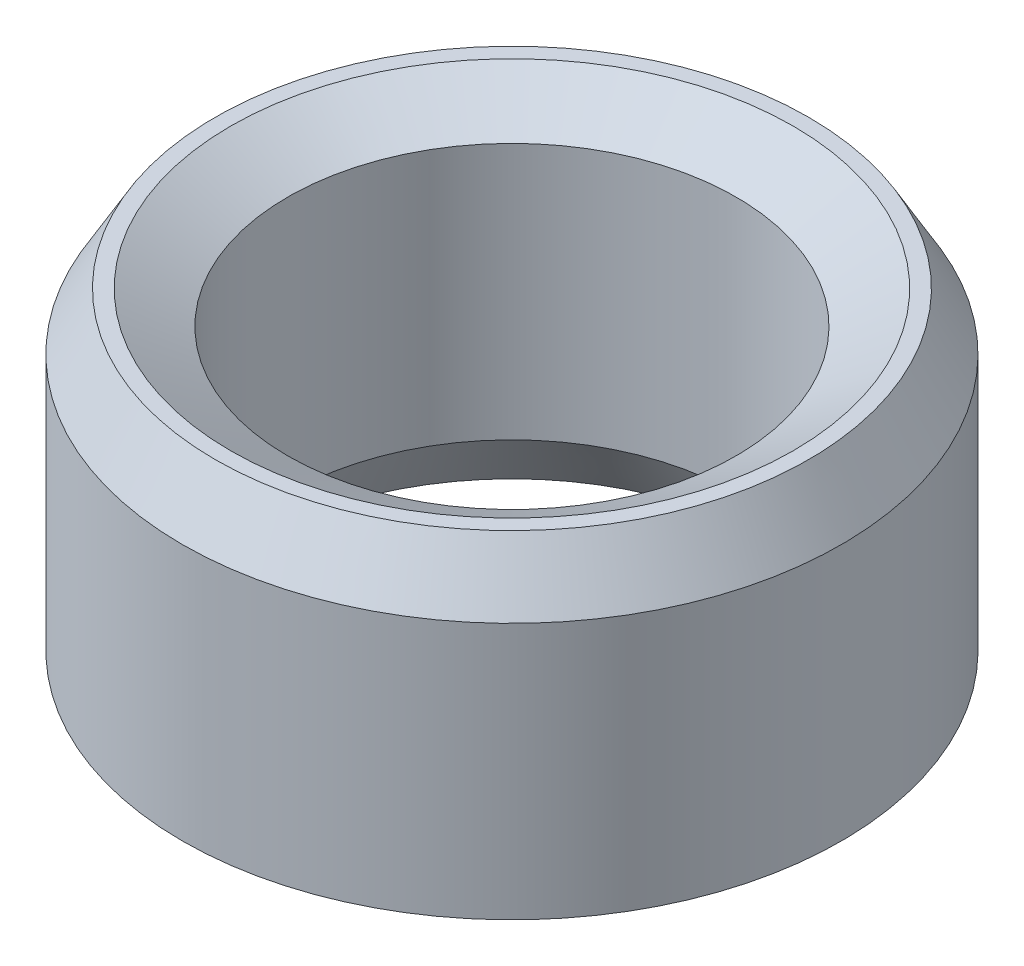
ISO-10303-21;
HEADER;
FILE_DESCRIPTION(('STEP AP214'),'2;1');
FILE_NAME('part.step','',(''),(''),'','','');
FILE_SCHEMA(('AUTOMOTIVE_DESIGN { 1 0 10303 214 1 1 1 1 }'));
ENDSEC;
DATA;
#1=APPLICATION_CONTEXT('core data for automotive mechanical design processes');
#2=APPLICATION_PROTOCOL_DEFINITION('international standard','automotive_design',2000,#1);
#3=PRODUCT_CONTEXT('',#1,'mechanical');
#4=PRODUCT('Part','Part','',(#3));
#5=PRODUCT_RELATED_PRODUCT_CATEGORY('part','',(#4));
#6=PRODUCT_DEFINITION_FORMATION('','',#4);
#7=PRODUCT_DEFINITION_CONTEXT('part definition',#1,'design');
#8=PRODUCT_DEFINITION('design','',#6,#7);
#9=PRODUCT_DEFINITION_SHAPE('','',#8);
#10=(LENGTH_UNIT() NAMED_UNIT(*) SI_UNIT(.MILLI.,.METRE.));
#11=(NAMED_UNIT(*) PLANE_ANGLE_UNIT() SI_UNIT($,.RADIAN.));
#12=(NAMED_UNIT(*) SI_UNIT($,.STERADIAN.) SOLID_ANGLE_UNIT());
#13=UNCERTAINTY_MEASURE_WITH_UNIT(LENGTH_MEASURE(1.E-05),#10,'distance_accuracy_value','');
#14=(GEOMETRIC_REPRESENTATION_CONTEXT(3) GLOBAL_UNCERTAINTY_ASSIGNED_CONTEXT((#13)) GLOBAL_UNIT_ASSIGNED_CONTEXT((#10,
#11,#12)) REPRESENTATION_CONTEXT('',''));
#15=CARTESIAN_POINT('',(0.,0.,0.));
#16=DIRECTION('',(0.,0.,1.));
#17=DIRECTION('',(1.,0.,0.));
#18=AXIS2_PLACEMENT_3D('',#15,#16,#17);
#19=CARTESIAN_POINT('',(0.,10.5202298279563,0.));
#20=DIRECTION('',(0.,-1.,0.));
#21=DIRECTION('',(0.,0.,-1.));
#22=AXIS2_PLACEMENT_3D('',#19,#20,#21);
#23=CYLINDRICAL_SURFACE('',#22,10.);
#24=CARTESIAN_POINT('',(0.,0.999339456152843,0.));
#25=DIRECTION('',(0.,1.,0.));
#26=DIRECTION('',(0.,0.,1.));
#27=AXIS2_PLACEMENT_3D('',#24,#25,#26);
#28=CIRCLE('',#27,10.);
#29=CARTESIAN_POINT('',(0.,0.999339456152843,10.));
#30=VERTEX_POINT('',#29);
#31=EDGE_CURVE('E10',#30,#30,#28,.T.);
#32=ORIENTED_EDGE('',*,*,#31,.T.);
#33=EDGE_LOOP('',(#32));
#34=FACE_BOUND('',#33,.T.);
#35=CARTESIAN_POINT('',(0.,8.78932311589135,0.));
#36=DIRECTION('',(0.,1.,0.));
#37=DIRECTION('',(0.,0.,1.));
#38=AXIS2_PLACEMENT_3D('',#35,#36,#37);
#39=CIRCLE('',#38,10.);
#40=CARTESIAN_POINT('',(0.,8.78932311589135,10.));
#41=VERTEX_POINT('',#40);
#42=EDGE_CURVE('E50',#41,#41,#39,.F.);
#43=ORIENTED_EDGE('',*,*,#42,.T.);
#44=EDGE_LOOP('',(#43));
#45=FACE_BOUND('',#44,.T.);
#46=ADVANCED_FACE('F39',(#34,#45),#23,.T.);
#47=CARTESIAN_POINT('',(0.,10.5202298279563,0.));
#48=DIRECTION('',(0.,1.,0.));
#49=DIRECTION('',(0.,0.,1.));
#50=AXIS2_PLACEMENT_3D('',#47,#48,#49);
#51=PLANE('',#50);
#52=CARTESIAN_POINT('',(0.,10.5202298279563,0.));
#53=DIRECTION('',(0.,1.,0.));
#54=DIRECTION('',(0.,0.,1.));
#55=AXIS2_PLACEMENT_3D('',#52,#53,#54);
#56=CIRCLE('',#55,8.53416372164878);
#57=CARTESIAN_POINT('',(0.,10.5202298279563,8.53416372164878));
#58=VERTEX_POINT('',#57);
#59=EDGE_CURVE('E58',#58,#58,#56,.F.);
#60=ORIENTED_EDGE('',*,*,#59,.T.);
#61=EDGE_LOOP('',(#60));
#62=FACE_BOUND('',#61,.T.);
#63=CARTESIAN_POINT('',(0.,10.5202298279563,0.));
#64=DIRECTION('',(0.,1.,0.));
#65=DIRECTION('',(0.,0.,1.));
#66=AXIS2_PLACEMENT_3D('',#63,#64,#65);
#67=CIRCLE('',#66,9.00066054384716);
#68=CARTESIAN_POINT('',(0.,10.5202298279563,9.00066054384716));
#69=VERTEX_POINT('',#68);
#70=EDGE_CURVE('E61',#69,#69,#67,.T.);
#71=ORIENTED_EDGE('',*,*,#70,.T.);
#72=EDGE_LOOP('',(#71));
#73=FACE_BOUND('',#72,.T.);
#74=ADVANCED_FACE('F88',(#62,#73),#51,.T.);
#75=CARTESIAN_POINT('',(0.,0.,0.));
#76=DIRECTION('',(0.,1.,0.));
#77=DIRECTION('',(0.,0.,1.));
#78=AXIS2_PLACEMENT_3D('',#75,#76,#77);
#79=PLANE('',#78);
#80=CARTESIAN_POINT('',(0.,0.,0.));
#81=DIRECTION('',(0.,1.,0.));
#82=DIRECTION('',(0.,0.,1.));
#83=AXIS2_PLACEMENT_3D('',#80,#81,#82);
#84=CIRCLE('',#83,7.80259646573664);
#85=CARTESIAN_POINT('',(0.,0.,7.80259646573664));
#86=VERTEX_POINT('',#85);
#87=EDGE_CURVE('E51',#86,#86,#84,.T.);
#88=ORIENTED_EDGE('',*,*,#87,.T.);
#89=EDGE_LOOP('',(#88));
#90=FACE_BOUND('',#89,.T.);
#91=CARTESIAN_POINT('',(0.,0.,0.));
#92=DIRECTION('',(0.,1.,0.));
#93=DIRECTION('',(0.,0.,1.));
#94=AXIS2_PLACEMENT_3D('',#91,#92,#93);
#95=CIRCLE('',#94,8.26909328793501);
#96=CARTESIAN_POINT('',(0.,0.,8.26909328793501));
#97=VERTEX_POINT('',#96);
#98=EDGE_CURVE('E54',#97,#97,#95,.F.);
#99=ORIENTED_EDGE('',*,*,#98,.T.);
#100=EDGE_LOOP('',(#99));
#101=FACE_BOUND('',#100,.T.);
#102=ADVANCED_FACE('F83',(#90,#101),#79,.F.);
#103=CARTESIAN_POINT('',(0.,10.5202298279563,0.));
#104=DIRECTION('',(0.,-1.,0.));
#105=DIRECTION('',(0.,0.,-1.));
#106=AXIS2_PLACEMENT_3D('',#103,#104,#105);
#107=CYLINDRICAL_SURFACE('',#106,6.8032570095838);
#108=CARTESIAN_POINT('',(0.,9.5208903718035,0.));
#109=DIRECTION('',(0.,1.,0.));
#110=DIRECTION('',(0.,0.,1.));
#111=AXIS2_PLACEMENT_3D('',#108,#109,#110);
#112=CIRCLE('',#111,6.8032570095838);
#113=CARTESIAN_POINT('',(0.,9.5208903718035,6.8032570095838));
#114=VERTEX_POINT('',#113);
#115=EDGE_CURVE('E67',#114,#114,#112,.T.);
#116=ORIENTED_EDGE('',*,*,#115,.T.);
#117=EDGE_LOOP('',(#116));
#118=FACE_BOUND('',#117,.T.);
#119=CARTESIAN_POINT('',(0.,1.73090671206498,0.));
#120=DIRECTION('',(0.,1.,0.));
#121=DIRECTION('',(0.,0.,1.));
#122=AXIS2_PLACEMENT_3D('',#119,#120,#121);
#123=CIRCLE('',#122,6.8032570095838);
#124=CARTESIAN_POINT('',(0.,1.73090671206498,6.8032570095838));
#125=VERTEX_POINT('',#124);
#126=EDGE_CURVE('E69',#125,#125,#123,.F.);
#127=ORIENTED_EDGE('',*,*,#126,.T.);
#128=EDGE_LOOP('',(#127));
#129=FACE_BOUND('',#128,.T.);
#130=ADVANCED_FACE('F71',(#118,#129),#107,.F.);
#131=CARTESIAN_POINT('',(0.,9.5208903718035,0.));
#132=DIRECTION('',(0.,1.,0.));
#133=DIRECTION('',(0.,0.,1.));
#134=AXIS2_PLACEMENT_3D('',#131,#132,#133);
#135=CONICAL_SURFACE('',#134,6.8032570095838,1.0471975511966);
#136=ORIENTED_EDGE('',*,*,#59,.F.);
#137=EDGE_LOOP('',(#136));
#138=FACE_BOUND('',#137,.T.);
#139=ORIENTED_EDGE('',*,*,#115,.F.);
#140=EDGE_LOOP('',(#139));
#141=FACE_BOUND('',#140,.T.);
#142=ADVANCED_FACE('F77',(#138,#141),#135,.F.);
#143=CARTESIAN_POINT('',(0.,0.,0.));
#144=DIRECTION('',(0.,-1.,0.));
#145=DIRECTION('',(0.,0.,-1.));
#146=AXIS2_PLACEMENT_3D('',#143,#144,#145);
#147=CONICAL_SURFACE('',#146,7.80259646573664,0.523598775598296);
#148=ORIENTED_EDGE('',*,*,#126,.F.);
#149=EDGE_LOOP('',(#148));
#150=FACE_BOUND('',#149,.T.);
#151=ORIENTED_EDGE('',*,*,#87,.F.);
#152=EDGE_LOOP('',(#151));
#153=FACE_BOUND('',#152,.T.);
#154=ADVANCED_FACE('F73',(#150,#153),#147,.F.);
#155=CARTESIAN_POINT('',(0.,0.999339456152843,0.));
#156=DIRECTION('',(0.,1.,0.));
#157=DIRECTION('',(0.,0.,1.));
#158=AXIS2_PLACEMENT_3D('',#155,#156,#157);
#159=CONICAL_SURFACE('',#158,10.,1.0471975511966);
#160=ORIENTED_EDGE('',*,*,#98,.F.);
#161=EDGE_LOOP('',(#160));
#162=FACE_BOUND('',#161,.T.);
#163=ORIENTED_EDGE('',*,*,#31,.F.);
#164=EDGE_LOOP('',(#163));
#165=FACE_BOUND('',#164,.T.);
#166=ADVANCED_FACE('F76',(#162,#165),#159,.T.);
#167=CARTESIAN_POINT('',(0.,10.5202298279563,0.));
#168=DIRECTION('',(0.,-1.,0.));
#169=DIRECTION('',(0.,0.,-1.));
#170=AXIS2_PLACEMENT_3D('',#167,#168,#169);
#171=CONICAL_SURFACE('',#170,9.00066054384716,0.523598775598296);
#172=ORIENTED_EDGE('',*,*,#42,.F.);
#173=EDGE_LOOP('',(#172));
#174=FACE_BOUND('',#173,.T.);
#175=ORIENTED_EDGE('',*,*,#70,.F.);
#176=EDGE_LOOP('',(#175));
#177=FACE_BOUND('',#176,.T.);
#178=ADVANCED_FACE('F45',(#174,#177),#171,.T.);
#179=CLOSED_SHELL('',(#46,#74,#102,#130,#142,#154,#166,#178));
#180=MANIFOLD_SOLID_BREP('B2',#179);
#181=ADVANCED_BREP_SHAPE_REPRESENTATION('',(#18,#180),#14);
#182=SHAPE_DEFINITION_REPRESENTATION(#9,#181);
ENDSEC;
END-ISO-10303-21;
